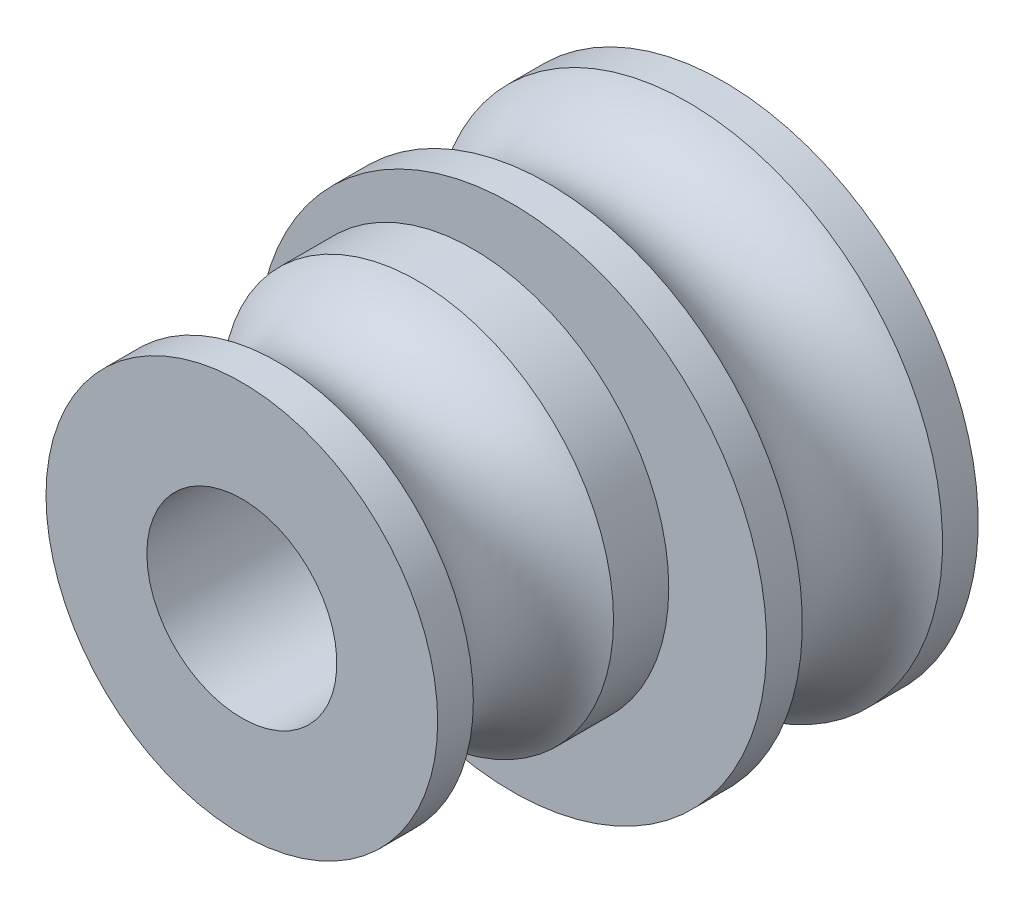
ISO-10303-21;
HEADER;
FILE_DESCRIPTION(('STEP AP214'),'2;1');
FILE_NAME('part.step','',(''),(''),'','','');
FILE_SCHEMA(('AUTOMOTIVE_DESIGN { 1 0 10303 214 1 1 1 1 }'));
ENDSEC;
DATA;
#1=APPLICATION_CONTEXT('core data for automotive mechanical design processes');
#2=APPLICATION_PROTOCOL_DEFINITION('international standard','automotive_design',2000,#1);
#3=PRODUCT_CONTEXT('',#1,'mechanical');
#4=PRODUCT('Part','Part','',(#3));
#5=PRODUCT_RELATED_PRODUCT_CATEGORY('part','',(#4));
#6=PRODUCT_DEFINITION_FORMATION('','',#4);
#7=PRODUCT_DEFINITION_CONTEXT('part definition',#1,'design');
#8=PRODUCT_DEFINITION('design','',#6,#7);
#9=PRODUCT_DEFINITION_SHAPE('','',#8);
#10=(LENGTH_UNIT() NAMED_UNIT(*) SI_UNIT(.MILLI.,.METRE.));
#11=(NAMED_UNIT(*) PLANE_ANGLE_UNIT() SI_UNIT($,.RADIAN.));
#12=(NAMED_UNIT(*) SI_UNIT($,.STERADIAN.) SOLID_ANGLE_UNIT());
#13=UNCERTAINTY_MEASURE_WITH_UNIT(LENGTH_MEASURE(1.E-05),#10,'distance_accuracy_value','');
#14=(GEOMETRIC_REPRESENTATION_CONTEXT(3) GLOBAL_UNCERTAINTY_ASSIGNED_CONTEXT((#13)) GLOBAL_UNIT_ASSIGNED_CONTEXT((#10,
#11,#12)) REPRESENTATION_CONTEXT('',''));
#15=CARTESIAN_POINT('',(0.,0.,0.));
#16=DIRECTION('',(0.,0.,1.));
#17=DIRECTION('',(1.,0.,0.));
#18=AXIS2_PLACEMENT_3D('',#15,#16,#17);
#19=CARTESIAN_POINT('',(0.,0.,2.7));
#20=DIRECTION('',(0.,0.,-1.));
#21=DIRECTION('',(-1.,0.,0.));
#22=AXIS2_PLACEMENT_3D('',#19,#20,#21);
#23=CYLINDRICAL_SURFACE('',#22,6.5);
#24=CARTESIAN_POINT('',(0.,0.,4.48955301681733));
#25=DIRECTION('',(0.,0.,-1.));
#26=DIRECTION('',(-1.,0.,0.));
#27=AXIS2_PLACEMENT_3D('',#24,#25,#26);
#28=CIRCLE('',#27,6.5);
#29=CARTESIAN_POINT('',(-6.5,0.,4.48955301681733));
#30=VERTEX_POINT('',#29);
#31=EDGE_CURVE('E65',#30,#30,#28,.F.);
#32=ORIENTED_EDGE('',*,*,#31,.T.);
#33=EDGE_LOOP('',(#32));
#34=FACE_BOUND('',#33,.T.);
#35=CARTESIAN_POINT('',(0.,0.,5.4));
#36=DIRECTION('',(0.,0.,-1.));
#37=DIRECTION('',(-1.,0.,0.));
#38=AXIS2_PLACEMENT_3D('',#35,#36,#37);
#39=CIRCLE('',#38,6.5);
#40=CARTESIAN_POINT('',(-6.5,0.,5.4));
#41=VERTEX_POINT('',#40);
#42=EDGE_CURVE('E63',#41,#41,#39,.F.);
#43=ORIENTED_EDGE('',*,*,#42,.F.);
#44=EDGE_LOOP('',(#43));
#45=FACE_BOUND('',#44,.T.);
#46=ADVANCED_FACE('F15',(#34,#45),#23,.T.);
#47=CARTESIAN_POINT('',(0.,0.,2.7));
#48=DIRECTION('',(0.,0.,-1.));
#49=DIRECTION('',(-1.,0.,0.));
#50=AXIS2_PLACEMENT_3D('',#47,#48,#49);
#51=TOROIDAL_SURFACE('',#50,7.5,2.05);
#52=ORIENTED_EDGE('',*,*,#31,.F.);
#53=EDGE_LOOP('',(#52));
#54=FACE_BOUND('',#53,.T.);
#55=CARTESIAN_POINT('',(0.,0.,0.910446983182672));
#56=DIRECTION('',(0.,0.,-1.));
#57=DIRECTION('',(-1.,0.,0.));
#58=AXIS2_PLACEMENT_3D('',#55,#56,#57);
#59=CIRCLE('',#58,6.5);
#60=CARTESIAN_POINT('',(-6.5,0.,0.910446983182672));
#61=VERTEX_POINT('',#60);
#62=EDGE_CURVE('E61',#61,#61,#59,.T.);
#63=ORIENTED_EDGE('',*,*,#62,.F.);
#64=EDGE_LOOP('',(#63));
#65=FACE_BOUND('',#64,.T.);
#66=ADVANCED_FACE('F77',(#54,#65),#51,.F.);
#67=CARTESIAN_POINT('',(-0.178416637254638,0.,5.4));
#68=DIRECTION('',(0.,0.,1.));
#69=DIRECTION('',(1.,0.,0.));
#70=AXIS2_PLACEMENT_3D('',#67,#68,#69);
#71=PLANE('',#70);
#72=ORIENTED_EDGE('',*,*,#42,.T.);
#73=EDGE_LOOP('',(#72));
#74=FACE_BOUND('',#73,.T.);
#75=CARTESIAN_POINT('',(-1.,0.,5.4));
#76=DIRECTION('',(0.,0.,-1.));
#77=DIRECTION('',(-1.,0.,0.));
#78=AXIS2_PLACEMENT_3D('',#75,#76,#77);
#79=CIRCLE('',#78,5.);
#80=CARTESIAN_POINT('',(-6.,0.,5.4));
#81=VERTEX_POINT('',#80);
#82=EDGE_CURVE('E56',#81,#81,#79,.F.);
#83=ORIENTED_EDGE('',*,*,#82,.F.);
#84=EDGE_LOOP('',(#83));
#85=FACE_BOUND('',#84,.T.);
#86=ADVANCED_FACE('F80',(#74,#85),#71,.T.);
#87=CARTESIAN_POINT('',(0.,0.,2.7));
#88=DIRECTION('',(0.,0.,-1.));
#89=DIRECTION('',(-1.,0.,0.));
#90=AXIS2_PLACEMENT_3D('',#87,#88,#89);
#91=CYLINDRICAL_SURFACE('',#90,6.5);
#92=ORIENTED_EDGE('',*,*,#62,.T.);
#93=EDGE_LOOP('',(#92));
#94=FACE_BOUND('',#93,.T.);
#95=CARTESIAN_POINT('',(0.,0.,0.));
#96=DIRECTION('',(0.,0.,-1.));
#97=DIRECTION('',(-1.,0.,0.));
#98=AXIS2_PLACEMENT_3D('',#95,#96,#97);
#99=CIRCLE('',#98,6.5);
#100=CARTESIAN_POINT('',(-6.5,0.,0.));
#101=VERTEX_POINT('',#100);
#102=EDGE_CURVE('E53',#101,#101,#99,.F.);
#103=ORIENTED_EDGE('',*,*,#102,.T.);
#104=EDGE_LOOP('',(#103));
#105=FACE_BOUND('',#104,.T.);
#106=ADVANCED_FACE('F84',(#94,#105),#91,.T.);
#107=CARTESIAN_POINT('',(-1.,0.,5.9));
#108=DIRECTION('',(0.,0.,-1.));
#109=DIRECTION('',(-1.,0.,0.));
#110=AXIS2_PLACEMENT_3D('',#107,#108,#109);
#111=CYLINDRICAL_SURFACE('',#110,5.);
#112=CARTESIAN_POINT('',(-1.,0.,6.81044698318267));
#113=DIRECTION('',(0.,0.,-1.));
#114=DIRECTION('',(-1.,0.,0.));
#115=AXIS2_PLACEMENT_3D('',#112,#113,#114);
#116=CIRCLE('',#115,5.);
#117=CARTESIAN_POINT('',(-6.,0.,6.81044698318267));
#118=VERTEX_POINT('',#117);
#119=EDGE_CURVE('E50',#118,#118,#116,.T.);
#120=ORIENTED_EDGE('',*,*,#119,.T.);
#121=EDGE_LOOP('',(#120));
#122=FACE_BOUND('',#121,.T.);
#123=ORIENTED_EDGE('',*,*,#82,.T.);
#124=EDGE_LOOP('',(#123));
#125=FACE_BOUND('',#124,.T.);
#126=ADVANCED_FACE('F87',(#122,#125),#111,.T.);
#127=CARTESIAN_POINT('',(-0.178416637254638,0.,0.));
#128=DIRECTION('',(0.,0.,1.));
#129=DIRECTION('',(1.,0.,0.));
#130=AXIS2_PLACEMENT_3D('',#127,#128,#129);
#131=PLANE('',#130);
#132=ORIENTED_EDGE('',*,*,#102,.F.);
#133=EDGE_LOOP('',(#132));
#134=FACE_BOUND('',#133,.T.);
#135=CARTESIAN_POINT('',(-1.,0.,0.));
#136=DIRECTION('',(0.,0.,1.));
#137=DIRECTION('',(1.,0.,0.));
#138=AXIS2_PLACEMENT_3D('',#135,#136,#137);
#139=CIRCLE('',#138,5.);
#140=CARTESIAN_POINT('',(4.,0.,0.));
#141=VERTEX_POINT('',#140);
#142=EDGE_CURVE('E47',#141,#141,#139,.F.);
#143=ORIENTED_EDGE('',*,*,#142,.F.);
#144=EDGE_LOOP('',(#143));
#145=FACE_BOUND('',#144,.T.);
#146=ADVANCED_FACE('F91',(#134,#145),#131,.F.);
#147=CARTESIAN_POINT('',(-1.,0.,8.6));
#148=DIRECTION('',(0.,0.,-1.));
#149=DIRECTION('',(-1.,0.,0.));
#150=AXIS2_PLACEMENT_3D('',#147,#148,#149);
#151=TOROIDAL_SURFACE('',#150,6.,2.05);
#152=CARTESIAN_POINT('',(-1.,0.,10.3895530168173));
#153=DIRECTION('',(0.,0.,-1.));
#154=DIRECTION('',(-1.,0.,0.));
#155=AXIS2_PLACEMENT_3D('',#152,#153,#154);
#156=CIRCLE('',#155,5.);
#157=CARTESIAN_POINT('',(-6.,0.,10.3895530168173));
#158=VERTEX_POINT('',#157);
#159=EDGE_CURVE('E44',#158,#158,#156,.F.);
#160=ORIENTED_EDGE('',*,*,#159,.F.);
#161=EDGE_LOOP('',(#160));
#162=FACE_BOUND('',#161,.T.);
#163=ORIENTED_EDGE('',*,*,#119,.F.);
#164=EDGE_LOOP('',(#163));
#165=FACE_BOUND('',#164,.T.);
#166=ADVANCED_FACE('F95',(#162,#165),#151,.F.);
#167=CARTESIAN_POINT('',(-1.,0.,-0.5));
#168=DIRECTION('',(0.,0.,1.));
#169=DIRECTION('',(1.,0.,0.));
#170=AXIS2_PLACEMENT_3D('',#167,#168,#169);
#171=CYLINDRICAL_SURFACE('',#170,5.);
#172=ORIENTED_EDGE('',*,*,#142,.T.);
#173=EDGE_LOOP('',(#172));
#174=FACE_BOUND('',#173,.T.);
#175=CARTESIAN_POINT('',(-1.,0.,-0.5));
#176=DIRECTION('',(0.,0.,1.));
#177=DIRECTION('',(1.,0.,0.));
#178=AXIS2_PLACEMENT_3D('',#175,#176,#177);
#179=CIRCLE('',#178,5.);
#180=CARTESIAN_POINT('',(4.,0.,-0.5));
#181=VERTEX_POINT('',#180);
#182=EDGE_CURVE('E39',#181,#181,#179,.F.);
#183=ORIENTED_EDGE('',*,*,#182,.F.);
#184=EDGE_LOOP('',(#183));
#185=FACE_BOUND('',#184,.T.);
#186=ADVANCED_FACE('F100',(#174,#185),#171,.T.);
#187=CARTESIAN_POINT('',(-1.,0.,5.4));
#188=DIRECTION('',(0.,0.,-1.));
#189=DIRECTION('',(-1.,0.,0.));
#190=AXIS2_PLACEMENT_3D('',#187,#188,#189);
#191=CYLINDRICAL_SURFACE('',#190,5.);
#192=CARTESIAN_POINT('',(-1.,0.,11.3));
#193=DIRECTION('',(0.,0.,-1.));
#194=DIRECTION('',(-1.,0.,0.));
#195=AXIS2_PLACEMENT_3D('',#192,#193,#194);
#196=CIRCLE('',#195,5.);
#197=CARTESIAN_POINT('',(-6.,0.,11.3));
#198=VERTEX_POINT('',#197);
#199=EDGE_CURVE('E27',#198,#198,#196,.F.);
#200=ORIENTED_EDGE('',*,*,#199,.F.);
#201=EDGE_LOOP('',(#200));
#202=FACE_BOUND('',#201,.T.);
#203=ORIENTED_EDGE('',*,*,#159,.T.);
#204=EDGE_LOOP('',(#203));
#205=FACE_BOUND('',#204,.T.);
#206=ADVANCED_FACE('F119',(#202,#205),#191,.T.);
#207=CARTESIAN_POINT('',(0.,0.,-0.5));
#208=DIRECTION('',(0.,0.,-1.));
#209=DIRECTION('',(-1.,0.,0.));
#210=AXIS2_PLACEMENT_3D('',#207,#208,#209);
#211=PLANE('',#210);
#212=ORIENTED_EDGE('',*,*,#182,.T.);
#213=EDGE_LOOP('',(#212));
#214=FACE_BOUND('',#213,.T.);
#215=CARTESIAN_POINT('',(-1.,0.,-0.5));
#216=DIRECTION('',(0.,0.,-1.));
#217=DIRECTION('',(-1.,0.,0.));
#218=AXIS2_PLACEMENT_3D('',#215,#216,#217);
#219=CIRCLE('',#218,2.425);
#220=CARTESIAN_POINT('',(-3.425,0.,-0.5));
#221=VERTEX_POINT('',#220);
#222=EDGE_CURVE('E22',#221,#221,#219,.F.);
#223=ORIENTED_EDGE('',*,*,#222,.T.);
#224=EDGE_LOOP('',(#223));
#225=FACE_BOUND('',#224,.T.);
#226=ADVANCED_FACE('F121',(#214,#225),#211,.T.);
#227=CARTESIAN_POINT('',(-1.,0.,11.3));
#228=DIRECTION('',(0.,0.,1.));
#229=DIRECTION('',(1.,0.,0.));
#230=AXIS2_PLACEMENT_3D('',#227,#228,#229);
#231=PLANE('',#230);
#232=ORIENTED_EDGE('',*,*,#199,.T.);
#233=EDGE_LOOP('',(#232));
#234=FACE_BOUND('',#233,.T.);
#235=CARTESIAN_POINT('',(-1.,0.,11.3));
#236=DIRECTION('',(0.,0.,-1.));
#237=DIRECTION('',(-1.,0.,0.));
#238=AXIS2_PLACEMENT_3D('',#235,#236,#237);
#239=CIRCLE('',#238,2.425);
#240=CARTESIAN_POINT('',(-3.425,0.,11.3));
#241=VERTEX_POINT('',#240);
#242=EDGE_CURVE('E10',#241,#241,#239,.T.);
#243=ORIENTED_EDGE('',*,*,#242,.T.);
#244=EDGE_LOOP('',(#243));
#245=FACE_BOUND('',#244,.T.);
#246=ADVANCED_FACE('F128',(#234,#245),#231,.T.);
#247=CARTESIAN_POINT('',(-1.,0.,53.8076141152203));
#248=DIRECTION('',(0.,0.,-1.));
#249=DIRECTION('',(-1.,0.,0.));
#250=AXIS2_PLACEMENT_3D('',#247,#248,#249);
#251=CYLINDRICAL_SURFACE('',#250,2.425);
#252=ORIENTED_EDGE('',*,*,#242,.F.);
#253=EDGE_LOOP('',(#252));
#254=FACE_BOUND('',#253,.T.);
#255=ORIENTED_EDGE('',*,*,#222,.F.);
#256=EDGE_LOOP('',(#255));
#257=FACE_BOUND('',#256,.T.);
#258=ADVANCED_FACE('F133',(#254,#257),#251,.F.);
#259=CLOSED_SHELL('',(#46,#66,#86,#106,#126,#146,#166,#186,#206,#226,#246,#258));
#260=MANIFOLD_SOLID_BREP('B1',#259);
#261=ADVANCED_BREP_SHAPE_REPRESENTATION('',(#18,#260),#14);
#262=SHAPE_DEFINITION_REPRESENTATION(#9,#261);
ENDSEC;
END-ISO-10303-21;
